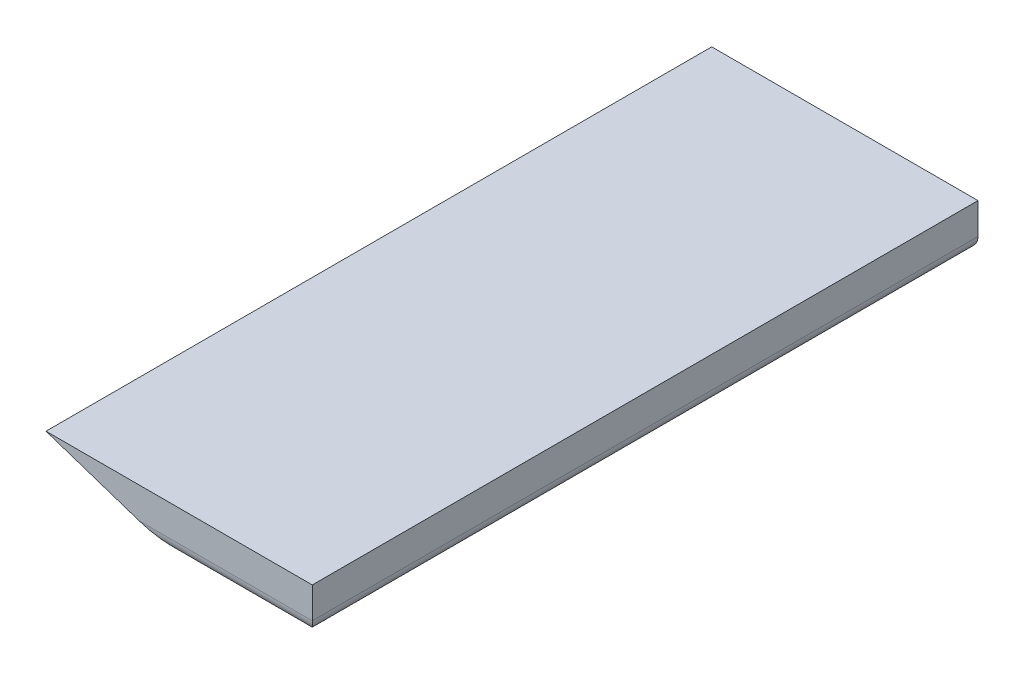
ISO-10303-21;
HEADER;
FILE_DESCRIPTION(('STEP AP214'),'2;1');
FILE_NAME('part.step','',(''),(''),'','','');
FILE_SCHEMA(('AUTOMOTIVE_DESIGN { 1 0 10303 214 1 1 1 1 }'));
ENDSEC;
DATA;
#1=APPLICATION_CONTEXT('core data for automotive mechanical design processes');
#2=APPLICATION_PROTOCOL_DEFINITION('international standard','automotive_design',2000,#1);
#3=PRODUCT_CONTEXT('',#1,'mechanical');
#4=PRODUCT('Part','Part','',(#3));
#5=PRODUCT_RELATED_PRODUCT_CATEGORY('part','',(#4));
#6=PRODUCT_DEFINITION_FORMATION('','',#4);
#7=PRODUCT_DEFINITION_CONTEXT('part definition',#1,'design');
#8=PRODUCT_DEFINITION('design','',#6,#7);
#9=PRODUCT_DEFINITION_SHAPE('','',#8);
#10=(LENGTH_UNIT() NAMED_UNIT(*) SI_UNIT(.MILLI.,.METRE.));
#11=(NAMED_UNIT(*) PLANE_ANGLE_UNIT() SI_UNIT($,.RADIAN.));
#12=(NAMED_UNIT(*) SI_UNIT($,.STERADIAN.) SOLID_ANGLE_UNIT());
#13=UNCERTAINTY_MEASURE_WITH_UNIT(LENGTH_MEASURE(1.E-05),#10,'distance_accuracy_value','');
#14=(GEOMETRIC_REPRESENTATION_CONTEXT(3) GLOBAL_UNCERTAINTY_ASSIGNED_CONTEXT((#13)) GLOBAL_UNIT_ASSIGNED_CONTEXT((#10,
#11,#12)) REPRESENTATION_CONTEXT('',''));
#15=CARTESIAN_POINT('',(0.,0.,0.));
#16=DIRECTION('',(0.,0.,1.));
#17=DIRECTION('',(1.,0.,0.));
#18=AXIS2_PLACEMENT_3D('',#15,#16,#17);
#19=CARTESIAN_POINT('',(30.,-5.,150.));
#20=DIRECTION('',(-1.,0.,0.));
#21=DIRECTION('',(0.,0.,1.));
#22=AXIS2_PLACEMENT_3D('',#19,#20,#21);
#23=PLANE('',#22);
#24=DIRECTION('',(0.,1.,0.));
#25=VECTOR('',#24,1.);
#26=CARTESIAN_POINT('',(30.,-5.,150.));
#27=LINE('',#26,#25);
#28=CARTESIAN_POINT('',(30.,-2.,150.));
#29=VERTEX_POINT('',#28);
#30=CARTESIAN_POINT('',(30.,5.,150.));
#31=VERTEX_POINT('',#30);
#32=EDGE_CURVE('E149',#29,#31,#27,.T.);
#33=ORIENTED_EDGE('',*,*,#32,.F.);
#34=DIRECTION('',(0.,0.,-1.));
#35=VECTOR('',#34,1.);
#36=CARTESIAN_POINT('',(30.,-2.,150.));
#37=LINE('',#36,#35);
#38=CARTESIAN_POINT('',(30.,-2.,0.));
#39=VERTEX_POINT('',#38);
#40=EDGE_CURVE('E157',#29,#39,#37,.T.);
#41=ORIENTED_EDGE('',*,*,#40,.T.);
#42=DIRECTION('',(0.,1.,0.));
#43=VECTOR('',#42,1.);
#44=CARTESIAN_POINT('',(30.,-5.,0.));
#45=LINE('',#44,#43);
#46=CARTESIAN_POINT('',(30.,5.,0.));
#47=VERTEX_POINT('',#46);
#48=EDGE_CURVE('E207',#39,#47,#45,.T.);
#49=ORIENTED_EDGE('',*,*,#48,.T.);
#50=DIRECTION('',(0.,0.,-1.));
#51=VECTOR('',#50,1.);
#52=CARTESIAN_POINT('',(30.,5.,150.));
#53=LINE('',#52,#51);
#54=EDGE_CURVE('E129',#31,#47,#53,.T.);
#55=ORIENTED_EDGE('',*,*,#54,.F.);
#56=EDGE_LOOP('',(#33,#41,#49,#55));
#57=FACE_BOUND('',#56,.T.);
#58=ADVANCED_FACE('F43',(#57),#23,.F.);
#59=CARTESIAN_POINT('',(-30.,5.,150.));
#60=DIRECTION('',(0.,-1.,0.));
#61=DIRECTION('',(0.,0.,-1.));
#62=AXIS2_PLACEMENT_3D('',#59,#60,#61);
#63=PLANE('',#62);
#64=DIRECTION('',(-1.,0.,0.));
#65=VECTOR('',#64,1.);
#66=CARTESIAN_POINT('',(-30.,5.,0.));
#67=LINE('',#66,#65);
#68=CARTESIAN_POINT('',(-30.,5.,0.));
#69=VERTEX_POINT('',#68);
#70=EDGE_CURVE('E144',#47,#69,#67,.T.);
#71=ORIENTED_EDGE('',*,*,#70,.T.);
#72=DIRECTION('',(0.,0.,-1.));
#73=VECTOR('',#72,1.);
#74=CARTESIAN_POINT('',(-30.,5.,150.));
#75=LINE('',#74,#73);
#76=CARTESIAN_POINT('',(-30.,5.,100.));
#77=VERTEX_POINT('',#76);
#78=EDGE_CURVE('E130',#77,#69,#75,.T.);
#79=ORIENTED_EDGE('',*,*,#78,.F.);
#80=CARTESIAN_POINT('',(-30.,5.,150.));
#81=VERTEX_POINT('',#80);
#82=EDGE_CURVE('E122',#81,#77,#75,.T.);
#83=ORIENTED_EDGE('',*,*,#82,.F.);
#84=DIRECTION('',(-1.,0.,0.));
#85=VECTOR('',#84,1.);
#86=CARTESIAN_POINT('',(-30.,5.,150.));
#87=LINE('',#86,#85);
#88=EDGE_CURVE('E147',#31,#81,#87,.T.);
#89=ORIENTED_EDGE('',*,*,#88,.F.);
#90=ORIENTED_EDGE('',*,*,#54,.T.);
#91=EDGE_LOOP('',(#71,#79,#83,#89,#90));
#92=FACE_BOUND('',#91,.T.);
#93=ADVANCED_FACE('F141',(#92),#63,.F.);
#94=CARTESIAN_POINT('',(-30.,-5.,150.));
#95=DIRECTION('',(1.,0.,0.));
#96=DIRECTION('',(0.,0.,-1.));
#97=AXIS2_PLACEMENT_3D('',#94,#95,#96);
#98=PLANE('',#97);
#99=DIRECTION('',(0.,-1.,0.));
#100=VECTOR('',#99,1.);
#101=CARTESIAN_POINT('',(-30.,-5.,0.));
#102=LINE('',#101,#100);
#103=CARTESIAN_POINT('',(-30.,-2.,0.));
#104=VERTEX_POINT('',#103);
#105=EDGE_CURVE('E223',#69,#104,#102,.T.);
#106=ORIENTED_EDGE('',*,*,#105,.T.);
#107=DIRECTION('',(0.,0.,-1.));
#108=VECTOR('',#107,1.);
#109=CARTESIAN_POINT('',(-30.,-2.,150.));
#110=LINE('',#109,#108);
#111=CARTESIAN_POINT('',(-30.,-2.,100.));
#112=VERTEX_POINT('',#111);
#113=EDGE_CURVE('E137',#104,#112,#110,.F.);
#114=ORIENTED_EDGE('',*,*,#113,.T.);
#115=DIRECTION('',(0.,-1.,0.));
#116=VECTOR('',#115,1.);
#117=CARTESIAN_POINT('',(-30.,5.,100.));
#118=LINE('',#117,#116);
#119=EDGE_CURVE('E116',#77,#112,#118,.T.);
#120=ORIENTED_EDGE('',*,*,#119,.F.);
#121=ORIENTED_EDGE('',*,*,#78,.T.);
#122=EDGE_LOOP('',(#106,#114,#120,#121));
#123=FACE_BOUND('',#122,.T.);
#124=ADVANCED_FACE('F134',(#123),#98,.F.);
#125=CARTESIAN_POINT('',(-30.,-5.,150.));
#126=DIRECTION('',(0.,1.,0.));
#127=DIRECTION('',(0.,0.,1.));
#128=AXIS2_PLACEMENT_3D('',#125,#126,#127);
#129=PLANE('',#128);
#130=DIRECTION('',(1.,0.,0.));
#131=VECTOR('',#130,1.);
#132=CARTESIAN_POINT('',(-30.,-5.,97.));
#133=LINE('',#132,#131);
#134=CARTESIAN_POINT('',(0.,-5.,97.));
#135=VERTEX_POINT('',#134);
#136=CARTESIAN_POINT('',(-27.,-5.,97.));
#137=VERTEX_POINT('',#136);
#138=EDGE_CURVE('E173',#135,#137,#133,.F.);
#139=ORIENTED_EDGE('',*,*,#138,.T.);
#140=DIRECTION('',(0.,0.,-1.));
#141=VECTOR('',#140,1.);
#142=CARTESIAN_POINT('',(-27.,-5.,150.));
#143=LINE('',#142,#141);
#144=CARTESIAN_POINT('',(-27.,-5.,0.));
#145=VERTEX_POINT('',#144);
#146=EDGE_CURVE('E176',#137,#145,#143,.T.);
#147=ORIENTED_EDGE('',*,*,#146,.T.);
#148=DIRECTION('',(1.,0.,0.));
#149=VECTOR('',#148,1.);
#150=CARTESIAN_POINT('',(-30.,-5.,0.));
#151=LINE('',#150,#149);
#152=CARTESIAN_POINT('',(27.,-5.,0.));
#153=VERTEX_POINT('',#152);
#154=EDGE_CURVE('E153',#145,#153,#151,.T.);
#155=ORIENTED_EDGE('',*,*,#154,.T.);
#156=DIRECTION('',(0.,0.,-1.));
#157=VECTOR('',#156,1.);
#158=CARTESIAN_POINT('',(27.,-5.,150.));
#159=LINE('',#158,#157);
#160=CARTESIAN_POINT('',(27.,-5.,147.));
#161=VERTEX_POINT('',#160);
#162=EDGE_CURVE('E170',#153,#161,#159,.F.);
#163=ORIENTED_EDGE('',*,*,#162,.T.);
#164=DIRECTION('',(1.,0.,0.));
#165=VECTOR('',#164,1.);
#166=CARTESIAN_POINT('',(-30.,-5.,147.));
#167=LINE('',#166,#165);
#168=CARTESIAN_POINT('',(0.,-5.,147.));
#169=VERTEX_POINT('',#168);
#170=EDGE_CURVE('E167',#161,#169,#167,.F.);
#171=ORIENTED_EDGE('',*,*,#170,.T.);
#172=DIRECTION('',(0.,0.,1.));
#173=VECTOR('',#172,1.);
#174=CARTESIAN_POINT('',(0.,-5.,100.));
#175=LINE('',#174,#173);
#176=EDGE_CURVE('E139',#135,#169,#175,.T.);
#177=ORIENTED_EDGE('',*,*,#176,.F.);
#178=EDGE_LOOP('',(#139,#147,#155,#163,#171,#177));
#179=FACE_BOUND('',#178,.T.);
#180=ADVANCED_FACE('F232',(#179),#129,.F.);
#181=CARTESIAN_POINT('',(0.,0.,150.));
#182=DIRECTION('',(0.,0.,-1.));
#183=DIRECTION('',(-1.,0.,0.));
#184=AXIS2_PLACEMENT_3D('',#181,#182,#183);
#185=PLANE('',#184);
#186=DIRECTION('',(-0.948683298050514,0.316227766016838,0.));
#187=VECTOR('',#186,1.);
#188=CARTESIAN_POINT('',(0.,-5.,150.));
#189=LINE('',#188,#187);
#190=CARTESIAN_POINT('',(-9.,-2.,150.));
#191=VERTEX_POINT('',#190);
#192=EDGE_CURVE('E119',#191,#81,#189,.T.);
#193=ORIENTED_EDGE('',*,*,#192,.F.);
#194=DIRECTION('',(1.,0.,0.));
#195=VECTOR('',#194,1.);
#196=CARTESIAN_POINT('',(0.,-2.,150.));
#197=LINE('',#196,#195);
#198=EDGE_CURVE('E184',#191,#29,#197,.T.);
#199=ORIENTED_EDGE('',*,*,#198,.T.);
#200=ORIENTED_EDGE('',*,*,#32,.T.);
#201=ORIENTED_EDGE('',*,*,#88,.T.);
#202=EDGE_LOOP('',(#193,#199,#200,#201));
#203=FACE_BOUND('',#202,.T.);
#204=ADVANCED_FACE('F215',(#203),#185,.F.);
#205=CARTESIAN_POINT('',(0.,0.,0.));
#206=DIRECTION('',(0.,0.,-1.));
#207=DIRECTION('',(-1.,0.,0.));
#208=AXIS2_PLACEMENT_3D('',#205,#206,#207);
#209=PLANE('',#208);
#210=ORIENTED_EDGE('',*,*,#48,.F.);
#211=CARTESIAN_POINT('',(27.,-2.,0.));
#212=DIRECTION('',(0.,0.,-1.));
#213=DIRECTION('',(-1.,0.,0.));
#214=AXIS2_PLACEMENT_3D('',#211,#212,#213);
#215=CIRCLE('',#214,3.);
#216=EDGE_CURVE('E164',#39,#153,#215,.T.);
#217=ORIENTED_EDGE('',*,*,#216,.T.);
#218=ORIENTED_EDGE('',*,*,#154,.F.);
#219=CARTESIAN_POINT('',(-27.,-2.,0.));
#220=DIRECTION('',(0.,0.,-1.));
#221=DIRECTION('',(-1.,0.,0.));
#222=AXIS2_PLACEMENT_3D('',#219,#220,#221);
#223=CIRCLE('',#222,3.);
#224=EDGE_CURVE('E161',#145,#104,#223,.T.);
#225=ORIENTED_EDGE('',*,*,#224,.T.);
#226=ORIENTED_EDGE('',*,*,#105,.F.);
#227=ORIENTED_EDGE('',*,*,#70,.F.);
#228=EDGE_LOOP('',(#210,#217,#218,#225,#226,#227));
#229=FACE_BOUND('',#228,.T.);
#230=ADVANCED_FACE('F230',(#229),#209,.T.);
#231=CARTESIAN_POINT('',(0.,-5.,100.));
#232=DIRECTION('',(0.316227766016838,0.948683298050514,0.));
#233=DIRECTION('',(-0.948683298050514,0.316227766016838,0.));
#234=AXIS2_PLACEMENT_3D('',#231,#232,#233);
#235=PLANE('',#234);
#236=ORIENTED_EDGE('',*,*,#176,.T.);
#237=CARTESIAN_POINT('',(-8.99999999999999,-2.,147.));
#238=DIRECTION('',(0.316227766016838,0.948683298050514,0.));
#239=DIRECTION('',(0.948683298050514,-0.316227766016838,0.));
#240=AXIS2_PLACEMENT_3D('',#237,#238,#239);
#241=ELLIPSE('',#240,9.48683298050514,3.);
#242=EDGE_CURVE('E53',#169,#191,#241,.F.);
#243=ORIENTED_EDGE('',*,*,#242,.T.);
#244=ORIENTED_EDGE('',*,*,#192,.T.);
#245=ORIENTED_EDGE('',*,*,#82,.T.);
#246=DIRECTION('',(-0.948683298050514,0.316227766016838,0.));
#247=VECTOR('',#246,1.);
#248=CARTESIAN_POINT('',(0.,-5.,100.));
#249=LINE('',#248,#247);
#250=CARTESIAN_POINT('',(-9.,-2.,100.));
#251=VERTEX_POINT('',#250);
#252=EDGE_CURVE('E112',#251,#77,#249,.T.);
#253=ORIENTED_EDGE('',*,*,#252,.F.);
#254=CARTESIAN_POINT('',(-8.99999999999999,-2.,97.));
#255=DIRECTION('',(0.316227766016838,0.948683298050514,0.));
#256=DIRECTION('',(0.948683298050514,-0.316227766016838,0.));
#257=AXIS2_PLACEMENT_3D('',#254,#255,#256);
#258=ELLIPSE('',#257,9.48683298050514,3.);
#259=EDGE_CURVE('E11',#251,#135,#258,.T.);
#260=ORIENTED_EDGE('',*,*,#259,.T.);
#261=EDGE_LOOP('',(#236,#243,#244,#245,#253,#260));
#262=FACE_BOUND('',#261,.T.);
#263=ADVANCED_FACE('F123',(#262),#235,.F.);
#264=CARTESIAN_POINT('',(0.,0.,100.));
#265=DIRECTION('',(0.,0.,-1.));
#266=DIRECTION('',(-1.,0.,0.));
#267=AXIS2_PLACEMENT_3D('',#264,#265,#266);
#268=PLANE('',#267);
#269=ORIENTED_EDGE('',*,*,#119,.T.);
#270=DIRECTION('',(1.,0.,0.));
#271=VECTOR('',#270,1.);
#272=CARTESIAN_POINT('',(0.,-2.,100.));
#273=LINE('',#272,#271);
#274=EDGE_CURVE('E68',#112,#251,#273,.T.);
#275=ORIENTED_EDGE('',*,*,#274,.T.);
#276=ORIENTED_EDGE('',*,*,#252,.T.);
#277=EDGE_LOOP('',(#269,#275,#276));
#278=FACE_BOUND('',#277,.T.);
#279=ADVANCED_FACE('F114',(#278),#268,.F.);
#280=CARTESIAN_POINT('',(0.,-2.,147.));
#281=DIRECTION('',(1.,0.,0.));
#282=DIRECTION('',(0.,0.,-1.));
#283=AXIS2_PLACEMENT_3D('',#280,#281,#282);
#284=CYLINDRICAL_SURFACE('',#283,3.);
#285=ORIENTED_EDGE('',*,*,#242,.F.);
#286=ORIENTED_EDGE('',*,*,#170,.F.);
#287=CARTESIAN_POINT('',(27.,-2.,147.));
#288=DIRECTION('',(0.707106781186547,0.,-0.707106781186547));
#289=DIRECTION('',(0.707106781186547,0.,0.707106781186547));
#290=AXIS2_PLACEMENT_3D('',#287,#288,#289);
#291=ELLIPSE('',#290,4.24264068711928,3.);
#292=EDGE_CURVE('E188',#29,#161,#291,.T.);
#293=ORIENTED_EDGE('',*,*,#292,.F.);
#294=ORIENTED_EDGE('',*,*,#198,.F.);
#295=EDGE_LOOP('',(#285,#286,#293,#294));
#296=FACE_BOUND('',#295,.T.);
#297=ADVANCED_FACE('F212',(#296),#284,.T.);
#298=CARTESIAN_POINT('',(27.,-2.,150.));
#299=DIRECTION('',(0.,0.,-1.));
#300=DIRECTION('',(-1.,0.,0.));
#301=AXIS2_PLACEMENT_3D('',#298,#299,#300);
#302=CYLINDRICAL_SURFACE('',#301,3.);
#303=ORIENTED_EDGE('',*,*,#292,.T.);
#304=ORIENTED_EDGE('',*,*,#162,.F.);
#305=ORIENTED_EDGE('',*,*,#216,.F.);
#306=ORIENTED_EDGE('',*,*,#40,.F.);
#307=EDGE_LOOP('',(#303,#304,#305,#306));
#308=FACE_BOUND('',#307,.T.);
#309=ADVANCED_FACE('F233',(#308),#302,.T.);
#310=CARTESIAN_POINT('',(0.,-2.,97.));
#311=DIRECTION('',(1.,0.,0.));
#312=DIRECTION('',(0.,0.,-1.));
#313=AXIS2_PLACEMENT_3D('',#310,#311,#312);
#314=CYLINDRICAL_SURFACE('',#313,3.);
#315=ORIENTED_EDGE('',*,*,#259,.F.);
#316=ORIENTED_EDGE('',*,*,#274,.F.);
#317=CARTESIAN_POINT('',(-27.,-2.,97.));
#318=DIRECTION('',(0.707106781186547,0.,0.707106781186547));
#319=DIRECTION('',(0.707106781186547,0.,-0.707106781186547));
#320=AXIS2_PLACEMENT_3D('',#317,#318,#319);
#321=ELLIPSE('',#320,4.24264068711928,3.);
#322=EDGE_CURVE('E47',#137,#112,#321,.F.);
#323=ORIENTED_EDGE('',*,*,#322,.F.);
#324=ORIENTED_EDGE('',*,*,#138,.F.);
#325=EDGE_LOOP('',(#315,#316,#323,#324));
#326=FACE_BOUND('',#325,.T.);
#327=ADVANCED_FACE('F45',(#326),#314,.T.);
#328=CARTESIAN_POINT('',(-27.,-2.,150.));
#329=DIRECTION('',(0.,0.,-1.));
#330=DIRECTION('',(-1.,0.,0.));
#331=AXIS2_PLACEMENT_3D('',#328,#329,#330);
#332=CYLINDRICAL_SURFACE('',#331,3.);
#333=ORIENTED_EDGE('',*,*,#322,.T.);
#334=ORIENTED_EDGE('',*,*,#113,.F.);
#335=ORIENTED_EDGE('',*,*,#224,.F.);
#336=ORIENTED_EDGE('',*,*,#146,.F.);
#337=EDGE_LOOP('',(#333,#334,#335,#336));
#338=FACE_BOUND('',#337,.T.);
#339=ADVANCED_FACE('F202',(#338),#332,.T.);
#340=CLOSED_SHELL('',(#58,#93,#124,#180,#204,#230,#263,#279,#297,#309,#327,#339));
#341=MANIFOLD_SOLID_BREP('B2',#340);
#342=ADVANCED_BREP_SHAPE_REPRESENTATION('',(#18,#341),#14);
#343=SHAPE_DEFINITION_REPRESENTATION(#9,#342);
ENDSEC;
END-ISO-10303-21;
